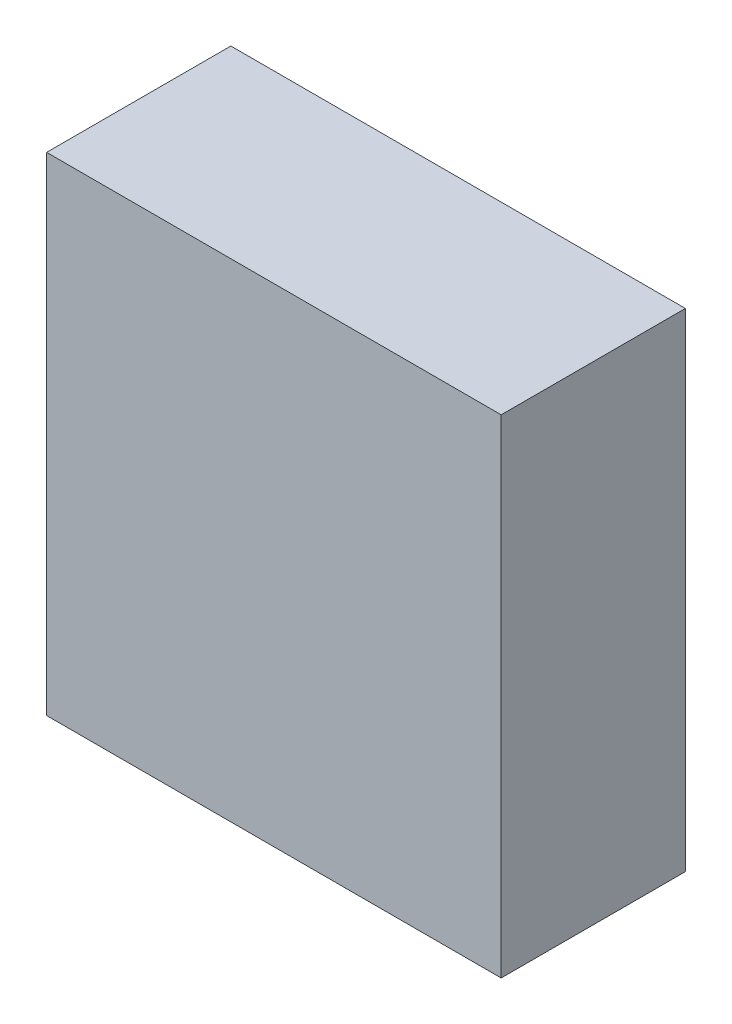
ISO-10303-21;
HEADER;
FILE_DESCRIPTION(('STEP AP214'),'2;1');
FILE_NAME('part.step','',(''),(''),'','','');
FILE_SCHEMA(('AUTOMOTIVE_DESIGN { 1 0 10303 214 1 1 1 1 }'));
ENDSEC;
DATA;
#1=APPLICATION_CONTEXT('core data for automotive mechanical design processes');
#2=APPLICATION_PROTOCOL_DEFINITION('international standard','automotive_design',2000,#1);
#3=PRODUCT_CONTEXT('',#1,'mechanical');
#4=PRODUCT('Part','Part','',(#3));
#5=PRODUCT_RELATED_PRODUCT_CATEGORY('part','',(#4));
#6=PRODUCT_DEFINITION_FORMATION('','',#4);
#7=PRODUCT_DEFINITION_CONTEXT('part definition',#1,'design');
#8=PRODUCT_DEFINITION('design','',#6,#7);
#9=PRODUCT_DEFINITION_SHAPE('','',#8);
#10=(LENGTH_UNIT() NAMED_UNIT(*) SI_UNIT(.MILLI.,.METRE.));
#11=(NAMED_UNIT(*) PLANE_ANGLE_UNIT() SI_UNIT($,.RADIAN.));
#12=(NAMED_UNIT(*) SI_UNIT($,.STERADIAN.) SOLID_ANGLE_UNIT());
#13=UNCERTAINTY_MEASURE_WITH_UNIT(LENGTH_MEASURE(1.E-05),#10,'distance_accuracy_value','');
#14=(GEOMETRIC_REPRESENTATION_CONTEXT(3) GLOBAL_UNCERTAINTY_ASSIGNED_CONTEXT((#13)) GLOBAL_UNIT_ASSIGNED_CONTEXT((#10,
#11,#12)) REPRESENTATION_CONTEXT('',''));
#15=CARTESIAN_POINT('',(0.,0.,0.));
#16=DIRECTION('',(0.,0.,1.));
#17=DIRECTION('',(1.,0.,0.));
#18=AXIS2_PLACEMENT_3D('',#15,#16,#17);
#19=CARTESIAN_POINT('',(-1.60001411625009,3.26999720998627,-4.61112093925476));
#20=DIRECTION('',(-1.,8.74227765734759E-08,0.));
#21=DIRECTION('',(-8.74227765734759E-08,-1.,0.));
#22=AXIS2_PLACEMENT_3D('',#19,#20,#21);
#23=PLANE('',#22);
#24=DIRECTION('',(-8.7422776579626E-08,-0.999999999999996,0.));
#25=VECTOR('',#24,1.);
#26=CARTESIAN_POINT('',(-1.60001411625009,3.26999720998627,-4.61112093925476));
#27=LINE('',#26,#25);
#28=CARTESIAN_POINT('',(-1.60001411625009,3.26999720998627,-4.61112093925476));
#29=VERTEX_POINT('',#28);
#30=CARTESIAN_POINT('',(-1.60001468799516,-3.27000370554107,-4.61112093925476));
#31=VERTEX_POINT('',#30);
#32=EDGE_CURVE('E11',#29,#31,#27,.T.);
#33=ORIENTED_EDGE('',*,*,#32,.T.);
#34=DIRECTION('',(0.,0.,1.));
#35=VECTOR('',#34,1.);
#36=CARTESIAN_POINT('',(-1.60001468799513,-3.27000370554107,-4.61112093925476));
#37=LINE('',#36,#35);
#38=CARTESIAN_POINT('',(-1.60001468799516,-3.27000370554107,-2.14112091064453));
#39=VERTEX_POINT('',#38);
#40=EDGE_CURVE('E88',#31,#39,#37,.T.);
#41=ORIENTED_EDGE('',*,*,#40,.T.);
#42=DIRECTION('',(-8.7422776579626E-08,-0.999999999999996,0.));
#43=VECTOR('',#42,1.);
#44=CARTESIAN_POINT('',(-1.60001411625009,3.26999720998627,-2.14112091064453));
#45=LINE('',#44,#43);
#46=CARTESIAN_POINT('',(-1.60001411625009,3.26999720998627,-2.14112091064453));
#47=VERTEX_POINT('',#46);
#48=EDGE_CURVE('E83',#47,#39,#45,.T.);
#49=ORIENTED_EDGE('',*,*,#48,.F.);
#50=DIRECTION('',(0.,0.,1.));
#51=VECTOR('',#50,1.);
#52=CARTESIAN_POINT('',(-1.60001411625009,3.26999720998628,-4.61112093925476));
#53=LINE('',#52,#51);
#54=EDGE_CURVE('E72',#29,#47,#53,.T.);
#55=ORIENTED_EDGE('',*,*,#54,.F.);
#56=EDGE_LOOP('',(#33,#41,#49,#55));
#57=FACE_BOUND('',#56,.T.);
#58=ADVANCED_FACE('F17',(#57),#23,.T.);
#59=CARTESIAN_POINT('',(-1.60001468799516,-3.27000370554107,-4.61112093925476));
#60=DIRECTION('',(-8.74227765734759E-08,-1.,0.));
#61=DIRECTION('',(1.,-8.74227765734759E-08,0.));
#62=AXIS2_PLACEMENT_3D('',#59,#60,#61);
#63=PLANE('',#62);
#64=DIRECTION('',(0.999999999999996,-8.74227766065619E-08,0.));
#65=VECTOR('',#64,1.);
#66=CARTESIAN_POINT('',(-1.60001468799516,-3.27000370554107,-4.61112093925476));
#67=LINE('',#66,#65);
#68=CARTESIAN_POINT('',(4.49498653270797,-3.270004238383,-4.61112093925476));
#69=VERTEX_POINT('',#68);
#70=EDGE_CURVE('E24',#31,#69,#67,.T.);
#71=ORIENTED_EDGE('',*,*,#70,.T.);
#72=DIRECTION('',(0.,0.,1.));
#73=VECTOR('',#72,1.);
#74=CARTESIAN_POINT('',(4.49498653270797,-3.270004238383,-4.61112093925476));
#75=LINE('',#74,#73);
#76=CARTESIAN_POINT('',(4.49498653270797,-3.270004238383,-2.14112091064453));
#77=VERTEX_POINT('',#76);
#78=EDGE_CURVE('E85',#69,#77,#75,.T.);
#79=ORIENTED_EDGE('',*,*,#78,.T.);
#80=DIRECTION('',(0.999999999999996,-8.74227766065619E-08,0.));
#81=VECTOR('',#80,1.);
#82=CARTESIAN_POINT('',(-1.60001468799516,-3.27000370554107,-2.14112091064453));
#83=LINE('',#82,#81);
#84=EDGE_CURVE('E66',#39,#77,#83,.T.);
#85=ORIENTED_EDGE('',*,*,#84,.F.);
#86=ORIENTED_EDGE('',*,*,#40,.F.);
#87=EDGE_LOOP('',(#71,#79,#85,#86));
#88=FACE_BOUND('',#87,.T.);
#89=ADVANCED_FACE('F89',(#88),#63,.T.);
#90=CARTESIAN_POINT('',(4.49498653270797,-3.270004238383,-4.61112093925476));
#91=DIRECTION('',(1.,-8.74227765734759E-08,0.));
#92=DIRECTION('',(8.74227765734759E-08,1.,0.));
#93=AXIS2_PLACEMENT_3D('',#90,#91,#92);
#94=PLANE('',#93);
#95=DIRECTION('',(8.7422776579626E-08,0.999999999999996,0.));
#96=VECTOR('',#95,1.);
#97=CARTESIAN_POINT('',(4.49498653270797,-3.270004238383,-4.61112093925476));
#98=LINE('',#97,#96);
#99=CARTESIAN_POINT('',(4.49498710445303,3.26999667714435,-4.61112093925476));
#100=VERTEX_POINT('',#99);
#101=EDGE_CURVE('E62',#69,#100,#98,.T.);
#102=ORIENTED_EDGE('',*,*,#101,.T.);
#103=DIRECTION('',(0.,0.,1.));
#104=VECTOR('',#103,1.);
#105=CARTESIAN_POINT('',(4.49498710445301,3.26999667714435,-4.61112093925476));
#106=LINE('',#105,#104);
#107=CARTESIAN_POINT('',(4.49498710445303,3.26999667714435,-2.14112091064453));
#108=VERTEX_POINT('',#107);
#109=EDGE_CURVE('E55',#100,#108,#106,.T.);
#110=ORIENTED_EDGE('',*,*,#109,.T.);
#111=DIRECTION('',(8.7422776579626E-08,0.999999999999996,0.));
#112=VECTOR('',#111,1.);
#113=CARTESIAN_POINT('',(4.49498653270797,-3.270004238383,-2.14112091064453));
#114=LINE('',#113,#112);
#115=EDGE_CURVE('E59',#77,#108,#114,.T.);
#116=ORIENTED_EDGE('',*,*,#115,.F.);
#117=ORIENTED_EDGE('',*,*,#78,.F.);
#118=EDGE_LOOP('',(#102,#110,#116,#117));
#119=FACE_BOUND('',#118,.T.);
#120=ADVANCED_FACE('F57',(#119),#94,.T.);
#121=CARTESIAN_POINT('',(4.49498710445303,3.26999667714435,-4.61112093925476));
#122=DIRECTION('',(8.74227765734759E-08,1.,0.));
#123=DIRECTION('',(-1.,8.74227765734759E-08,0.));
#124=AXIS2_PLACEMENT_3D('',#121,#122,#123);
#125=PLANE('',#124);
#126=DIRECTION('',(-0.999999999999996,8.74227766065619E-08,0.));
#127=VECTOR('',#126,1.);
#128=CARTESIAN_POINT('',(4.49498710445303,3.26999667714435,-4.61112093925476));
#129=LINE('',#128,#127);
#130=EDGE_CURVE('E65',#100,#29,#129,.T.);
#131=ORIENTED_EDGE('',*,*,#130,.T.);
#132=ORIENTED_EDGE('',*,*,#54,.T.);
#133=DIRECTION('',(-0.999999999999996,8.74227766065619E-08,0.));
#134=VECTOR('',#133,1.);
#135=CARTESIAN_POINT('',(4.49498710445303,3.26999667714435,-2.14112091064453));
#136=LINE('',#135,#134);
#137=EDGE_CURVE('E70',#108,#47,#136,.T.);
#138=ORIENTED_EDGE('',*,*,#137,.F.);
#139=ORIENTED_EDGE('',*,*,#109,.F.);
#140=EDGE_LOOP('',(#131,#132,#138,#139));
#141=FACE_BOUND('',#140,.T.);
#142=ADVANCED_FACE('F71',(#141),#125,.T.);
#143=CARTESIAN_POINT('',(179.425003051758,94.9249801635742,-2.14112091064453));
#144=DIRECTION('',(0.,0.,1.));
#145=DIRECTION('',(-1.,8.74227765734759E-08,0.));
#146=AXIS2_PLACEMENT_3D('',#143,#144,#145);
#147=PLANE('',#146);
#148=ORIENTED_EDGE('',*,*,#48,.T.);
#149=ORIENTED_EDGE('',*,*,#84,.T.);
#150=ORIENTED_EDGE('',*,*,#115,.T.);
#151=ORIENTED_EDGE('',*,*,#137,.T.);
#152=EDGE_LOOP('',(#148,#149,#150,#151));
#153=FACE_BOUND('',#152,.T.);
#154=ADVANCED_FACE('F76',(#153),#147,.T.);
#155=CARTESIAN_POINT('',(179.425003051758,94.9249801635742,-4.61112093925476));
#156=DIRECTION('',(0.,0.,1.));
#157=DIRECTION('',(-1.,8.74227765734759E-08,0.));
#158=AXIS2_PLACEMENT_3D('',#155,#156,#157);
#159=PLANE('',#158);
#160=ORIENTED_EDGE('',*,*,#130,.F.);
#161=ORIENTED_EDGE('',*,*,#101,.F.);
#162=ORIENTED_EDGE('',*,*,#70,.F.);
#163=ORIENTED_EDGE('',*,*,#32,.F.);
#164=EDGE_LOOP('',(#160,#161,#162,#163));
#165=FACE_BOUND('',#164,.T.);
#166=ADVANCED_FACE('F91',(#165),#159,.F.);
#167=CLOSED_SHELL('',(#58,#89,#120,#142,#154,#166));
#168=MANIFOLD_SOLID_BREP('B1',#167);
#169=ADVANCED_BREP_SHAPE_REPRESENTATION('',(#18,#168),#14);
#170=SHAPE_DEFINITION_REPRESENTATION(#9,#169);
ENDSEC;
END-ISO-10303-21;
